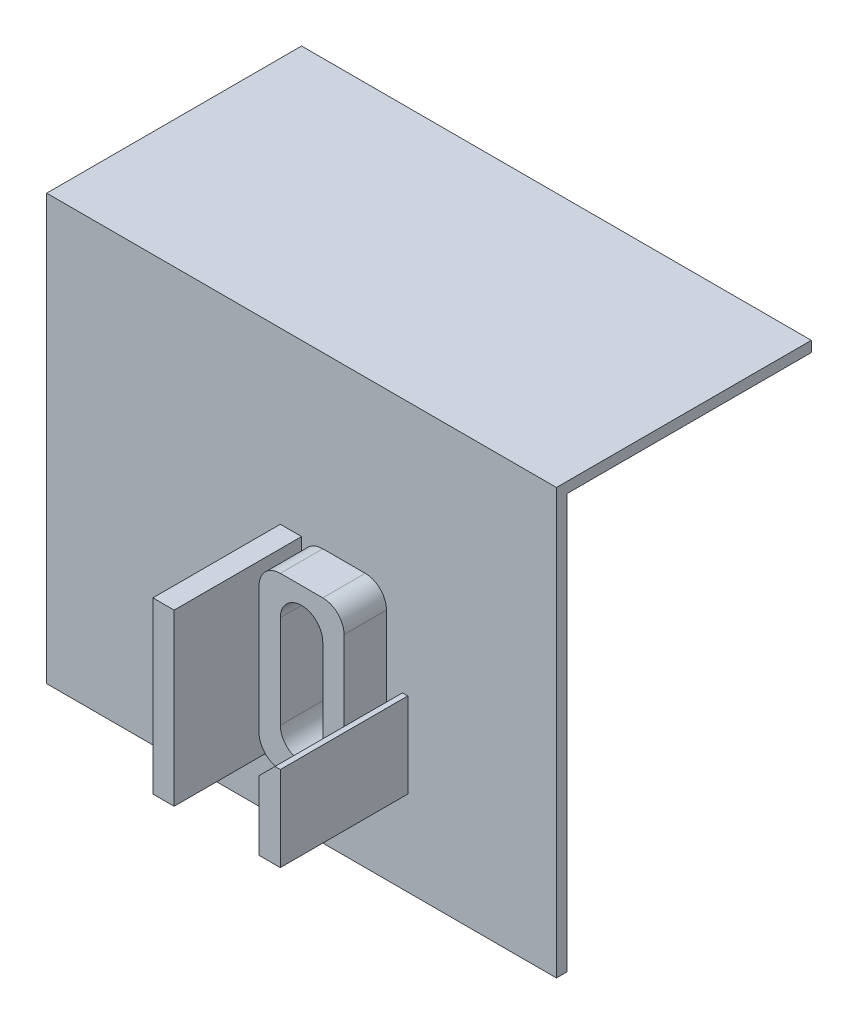
ISO-10303-21;
HEADER;
FILE_DESCRIPTION(('STEP AP214'),'2;1');
FILE_NAME('part.step','',(''),(''),'','','');
FILE_SCHEMA(('AUTOMOTIVE_DESIGN { 1 0 10303 214 1 1 1 1 }'));
ENDSEC;
DATA;
#1=APPLICATION_CONTEXT('core data for automotive mechanical design processes');
#2=APPLICATION_PROTOCOL_DEFINITION('international standard','automotive_design',2000,#1);
#3=PRODUCT_CONTEXT('',#1,'mechanical');
#4=PRODUCT('Part','Part','',(#3));
#5=PRODUCT_RELATED_PRODUCT_CATEGORY('part','',(#4));
#6=PRODUCT_DEFINITION_FORMATION('','',#4);
#7=PRODUCT_DEFINITION_CONTEXT('part definition',#1,'design');
#8=PRODUCT_DEFINITION('design','',#6,#7);
#9=PRODUCT_DEFINITION_SHAPE('','',#8);
#10=(LENGTH_UNIT() NAMED_UNIT(*) SI_UNIT(.MILLI.,.METRE.));
#11=(NAMED_UNIT(*) PLANE_ANGLE_UNIT() SI_UNIT($,.RADIAN.));
#12=(NAMED_UNIT(*) SI_UNIT($,.STERADIAN.) SOLID_ANGLE_UNIT());
#13=UNCERTAINTY_MEASURE_WITH_UNIT(LENGTH_MEASURE(1.E-05),#10,'distance_accuracy_value','');
#14=(GEOMETRIC_REPRESENTATION_CONTEXT(3) GLOBAL_UNCERTAINTY_ASSIGNED_CONTEXT((#13)) GLOBAL_UNIT_ASSIGNED_CONTEXT((#10,
#11,#12)) REPRESENTATION_CONTEXT('',''));
#15=CARTESIAN_POINT('',(0.,0.,0.));
#16=DIRECTION('',(0.,0.,1.));
#17=DIRECTION('',(1.,0.,0.));
#18=AXIS2_PLACEMENT_3D('',#15,#16,#17);
#19=CARTESIAN_POINT('',(76.2,0.,0.));
#20=DIRECTION('',(0.,0.,-1.));
#21=DIRECTION('',(-1.,0.,0.));
#22=AXIS2_PLACEMENT_3D('',#19,#20,#21);
#23=PLANE('',#22);
#24=DIRECTION('',(0.,-1.,0.));
#25=VECTOR('',#24,1.);
#26=CARTESIAN_POINT('',(0.,0.,0.));
#27=LINE('',#26,#25);
#28=CARTESIAN_POINT('',(0.,63.5,0.));
#29=VERTEX_POINT('',#28);
#30=CARTESIAN_POINT('',(0.,0.,0.));
#31=VERTEX_POINT('',#30);
#32=EDGE_CURVE('E422',#29,#31,#27,.T.);
#33=ORIENTED_EDGE('',*,*,#32,.T.);
#34=DIRECTION('',(-1.,0.,0.));
#35=VECTOR('',#34,1.);
#36=CARTESIAN_POINT('',(76.2,0.,0.));
#37=LINE('',#36,#35);
#38=CARTESIAN_POINT('',(76.2,0.,0.));
#39=VERTEX_POINT('',#38);
#40=EDGE_CURVE('E437',#39,#31,#37,.T.);
#41=ORIENTED_EDGE('',*,*,#40,.F.);
#42=DIRECTION('',(0.,-1.,0.));
#43=VECTOR('',#42,1.);
#44=CARTESIAN_POINT('',(76.2,0.,0.));
#45=LINE('',#44,#43);
#46=CARTESIAN_POINT('',(76.2,63.5,0.));
#47=VERTEX_POINT('',#46);
#48=EDGE_CURVE('E434',#47,#39,#45,.T.);
#49=ORIENTED_EDGE('',*,*,#48,.F.);
#50=DIRECTION('',(-1.,0.,0.));
#51=VECTOR('',#50,1.);
#52=CARTESIAN_POINT('',(76.2,63.5,0.));
#53=LINE('',#52,#51);
#54=EDGE_CURVE('E458',#47,#29,#53,.T.);
#55=ORIENTED_EDGE('',*,*,#54,.T.);
#56=EDGE_LOOP('',(#33,#41,#49,#55));
#57=FACE_BOUND('',#56,.T.);
#58=DIRECTION('',(0.,1.,0.));
#59=VECTOR('',#58,1.);
#60=CARTESIAN_POINT('',(38.1,12.7,0.));
#61=LINE('',#60,#59);
#62=CARTESIAN_POINT('',(38.1,12.7,0.));
#63=VERTEX_POINT('',#62);
#64=CARTESIAN_POINT('',(38.1,15.875,0.));
#65=VERTEX_POINT('',#64);
#66=EDGE_CURVE('E613',#63,#65,#61,.T.);
#67=ORIENTED_EDGE('',*,*,#66,.F.);
#68=DIRECTION('',(1.,0.,0.));
#69=VECTOR('',#68,1.);
#70=CARTESIAN_POINT('',(38.1,12.7,0.));
#71=LINE('',#70,#69);
#72=CARTESIAN_POINT('',(34.925,12.7,0.));
#73=VERTEX_POINT('',#72);
#74=EDGE_CURVE('E243',#73,#63,#71,.T.);
#75=ORIENTED_EDGE('',*,*,#74,.F.);
#76=DIRECTION('',(0.,-1.,0.));
#77=VECTOR('',#76,1.);
#78=CARTESIAN_POINT('',(34.925,12.7,0.));
#79=LINE('',#78,#77);
#80=CARTESIAN_POINT('',(34.925,38.1,0.));
#81=VERTEX_POINT('',#80);
#82=EDGE_CURVE('E620',#81,#73,#79,.T.);
#83=ORIENTED_EDGE('',*,*,#82,.F.);
#84=DIRECTION('',(-1.,0.,0.));
#85=VECTOR('',#84,1.);
#86=CARTESIAN_POINT('',(38.1,38.1,0.));
#87=LINE('',#86,#85);
#88=CARTESIAN_POINT('',(38.1,38.1,0.));
#89=VERTEX_POINT('',#88);
#90=EDGE_CURVE('E616',#89,#81,#87,.T.);
#91=ORIENTED_EDGE('',*,*,#90,.F.);
#92=CARTESIAN_POINT('',(38.1,34.925,0.));
#93=VERTEX_POINT('',#92);
#94=EDGE_CURVE('E247',#93,#89,#61,.T.);
#95=ORIENTED_EDGE('',*,*,#94,.F.);
#96=CARTESIAN_POINT('',(41.275,34.925,0.));
#97=DIRECTION('',(0.,0.,1.));
#98=DIRECTION('',(-1.,0.,0.));
#99=AXIS2_PLACEMENT_3D('',#96,#97,#98);
#100=CIRCLE('',#99,3.175);
#101=CARTESIAN_POINT('',(41.275,38.1,0.));
#102=VERTEX_POINT('',#101);
#103=EDGE_CURVE('E375',#102,#93,#100,.T.);
#104=ORIENTED_EDGE('',*,*,#103,.F.);
#105=DIRECTION('',(-1.,0.,0.));
#106=VECTOR('',#105,1.);
#107=CARTESIAN_POINT('',(41.275,38.1,0.));
#108=LINE('',#107,#106);
#109=CARTESIAN_POINT('',(47.625,38.1,0.));
#110=VERTEX_POINT('',#109);
#111=EDGE_CURVE('E371',#110,#102,#108,.T.);
#112=ORIENTED_EDGE('',*,*,#111,.F.);
#113=CARTESIAN_POINT('',(47.625,34.925,0.));
#114=DIRECTION('',(0.,0.,1.));
#115=DIRECTION('',(-1.,0.,0.));
#116=AXIS2_PLACEMENT_3D('',#113,#114,#115);
#117=CIRCLE('',#116,3.175);
#118=CARTESIAN_POINT('',(50.8,34.925,0.));
#119=VERTEX_POINT('',#118);
#120=EDGE_CURVE('E367',#119,#110,#117,.T.);
#121=ORIENTED_EDGE('',*,*,#120,.F.);
#122=DIRECTION('',(0.,1.,0.));
#123=VECTOR('',#122,1.);
#124=CARTESIAN_POINT('',(50.8,15.875,0.));
#125=LINE('',#124,#123);
#126=CARTESIAN_POINT('',(50.8,23.01875,0.));
#127=VERTEX_POINT('',#126);
#128=EDGE_CURVE('E364',#127,#119,#125,.T.);
#129=ORIENTED_EDGE('',*,*,#128,.F.);
#130=DIRECTION('',(-0.707106781186547,-0.707106781186548,0.));
#131=VECTOR('',#130,1.);
#132=CARTESIAN_POINT('',(50.8,23.01875,0.));
#133=LINE('',#132,#131);
#134=CARTESIAN_POINT('',(53.18125,25.4,0.));
#135=VERTEX_POINT('',#134);
#136=EDGE_CURVE('E55',#135,#127,#133,.T.);
#137=ORIENTED_EDGE('',*,*,#136,.F.);
#138=DIRECTION('',(-1.,0.,0.));
#139=VECTOR('',#138,1.);
#140=CARTESIAN_POINT('',(53.18125,25.4,0.));
#141=LINE('',#140,#139);
#142=CARTESIAN_POINT('',(53.975,25.4,0.));
#143=VERTEX_POINT('',#142);
#144=EDGE_CURVE('E59',#143,#135,#141,.T.);
#145=ORIENTED_EDGE('',*,*,#144,.F.);
#146=DIRECTION('',(0.,1.,0.));
#147=VECTOR('',#146,1.);
#148=CARTESIAN_POINT('',(53.975,25.4,0.));
#149=LINE('',#148,#147);
#150=CARTESIAN_POINT('',(53.975,12.7,0.));
#151=VERTEX_POINT('',#150);
#152=EDGE_CURVE('E254',#151,#143,#149,.T.);
#153=ORIENTED_EDGE('',*,*,#152,.F.);
#154=DIRECTION('',(1.,0.,0.));
#155=VECTOR('',#154,1.);
#156=CARTESIAN_POINT('',(53.975,12.7,0.));
#157=LINE('',#156,#155);
#158=CARTESIAN_POINT('',(50.8,12.7,0.));
#159=VERTEX_POINT('',#158);
#160=EDGE_CURVE('E249',#159,#151,#157,.T.);
#161=ORIENTED_EDGE('',*,*,#160,.F.);
#162=DIRECTION('',(0.,-1.,0.));
#163=VECTOR('',#162,1.);
#164=CARTESIAN_POINT('',(50.8,12.7,0.));
#165=LINE('',#164,#163);
#166=CARTESIAN_POINT('',(50.8,15.875,0.));
#167=VERTEX_POINT('',#166);
#168=EDGE_CURVE('E265',#167,#159,#165,.T.);
#169=ORIENTED_EDGE('',*,*,#168,.F.);
#170=CARTESIAN_POINT('',(47.625,15.875,0.));
#171=DIRECTION('',(0.,0.,1.));
#172=DIRECTION('',(1.,0.,0.));
#173=AXIS2_PLACEMENT_3D('',#170,#171,#172);
#174=CIRCLE('',#173,3.175);
#175=CARTESIAN_POINT('',(47.625,12.7,0.));
#176=VERTEX_POINT('',#175);
#177=EDGE_CURVE('E331',#176,#167,#174,.T.);
#178=ORIENTED_EDGE('',*,*,#177,.F.);
#179=DIRECTION('',(1.,0.,0.));
#180=VECTOR('',#179,1.);
#181=CARTESIAN_POINT('',(41.275,12.7,0.));
#182=LINE('',#181,#180);
#183=CARTESIAN_POINT('',(41.275,12.7,0.));
#184=VERTEX_POINT('',#183);
#185=EDGE_CURVE('E336',#184,#176,#182,.T.);
#186=ORIENTED_EDGE('',*,*,#185,.F.);
#187=CARTESIAN_POINT('',(41.275,15.875,0.));
#188=DIRECTION('',(0.,0.,1.));
#189=DIRECTION('',(-1.,0.,0.));
#190=AXIS2_PLACEMENT_3D('',#187,#188,#189);
#191=CIRCLE('',#190,3.175);
#192=EDGE_CURVE('E379',#65,#184,#191,.T.);
#193=ORIENTED_EDGE('',*,*,#192,.F.);
#194=EDGE_LOOP('',(#67,#75,#83,#91,#95,#104,#112,#121,#129,#137,#145,#153,#161,#169,#178,#186,#193));
#195=FACE_BOUND('',#194,.T.);
#196=ADVANCED_FACE('F39',(#57,#195),#23,.F.);
#197=CARTESIAN_POINT('',(50.8,15.875,6.35));
#198=DIRECTION('',(-1.,0.,0.));
#199=DIRECTION('',(0.,0.,1.));
#200=AXIS2_PLACEMENT_3D('',#197,#198,#199);
#201=PLANE('',#200);
#202=DIRECTION('',(0.,0.,1.));
#203=VECTOR('',#202,1.);
#204=CARTESIAN_POINT('',(50.8,23.01875,6.35));
#205=LINE('',#204,#203);
#206=CARTESIAN_POINT('',(50.8,23.01875,6.35));
#207=VERTEX_POINT('',#206);
#208=EDGE_CURVE('E11',#127,#207,#205,.T.);
#209=ORIENTED_EDGE('',*,*,#208,.F.);
#210=ORIENTED_EDGE('',*,*,#128,.T.);
#211=DIRECTION('',(0.,0.,-1.));
#212=VECTOR('',#211,1.);
#213=CARTESIAN_POINT('',(50.8,34.925,6.35));
#214=LINE('',#213,#212);
#215=CARTESIAN_POINT('',(50.8,34.925,6.35));
#216=VERTEX_POINT('',#215);
#217=EDGE_CURVE('E408',#216,#119,#214,.T.);
#218=ORIENTED_EDGE('',*,*,#217,.F.);
#219=DIRECTION('',(0.,1.,0.));
#220=VECTOR('',#219,1.);
#221=CARTESIAN_POINT('',(50.8,15.875,6.35));
#222=LINE('',#221,#220);
#223=EDGE_CURVE('E335',#207,#216,#222,.T.);
#224=ORIENTED_EDGE('',*,*,#223,.F.);
#225=EDGE_LOOP('',(#209,#210,#218,#224));
#226=FACE_BOUND('',#225,.T.);
#227=ADVANCED_FACE('F533',(#226),#201,.F.);
#228=CARTESIAN_POINT('',(76.2,0.,-1.5875));
#229=DIRECTION('',(0.,1.,0.));
#230=DIRECTION('',(0.,0.,1.));
#231=AXIS2_PLACEMENT_3D('',#228,#229,#230);
#232=PLANE('',#231);
#233=DIRECTION('',(0.,0.,-1.));
#234=VECTOR('',#233,1.);
#235=CARTESIAN_POINT('',(0.,0.,-1.5875));
#236=LINE('',#235,#234);
#237=CARTESIAN_POINT('',(0.,0.,-1.5875));
#238=VERTEX_POINT('',#237);
#239=EDGE_CURVE('E416',#31,#238,#236,.T.);
#240=ORIENTED_EDGE('',*,*,#239,.T.);
#241=DIRECTION('',(-1.,0.,0.));
#242=VECTOR('',#241,1.);
#243=CARTESIAN_POINT('',(76.2,0.,-1.5875));
#244=LINE('',#243,#242);
#245=CARTESIAN_POINT('',(76.2,0.,-1.5875));
#246=VERTEX_POINT('',#245);
#247=EDGE_CURVE('E474',#246,#238,#244,.T.);
#248=ORIENTED_EDGE('',*,*,#247,.F.);
#249=DIRECTION('',(0.,0.,-1.));
#250=VECTOR('',#249,1.);
#251=CARTESIAN_POINT('',(76.2,0.,-1.5875));
#252=LINE('',#251,#250);
#253=EDGE_CURVE('E417',#39,#246,#252,.T.);
#254=ORIENTED_EDGE('',*,*,#253,.F.);
#255=ORIENTED_EDGE('',*,*,#40,.T.);
#256=EDGE_LOOP('',(#240,#248,#254,#255));
#257=FACE_BOUND('',#256,.T.);
#258=ADVANCED_FACE('F41',(#257),#232,.F.);
#259=CARTESIAN_POINT('',(76.2,61.9125,-1.58749999999999));
#260=DIRECTION('',(0.,0.,1.));
#261=DIRECTION('',(0.,-1.,0.));
#262=AXIS2_PLACEMENT_3D('',#259,#260,#261);
#263=PLANE('',#262);
#264=DIRECTION('',(0.,-1.,0.));
#265=VECTOR('',#264,1.);
#266=CARTESIAN_POINT('',(41.275,61.9125,-1.58749999999999));
#267=LINE('',#266,#265);
#268=CARTESIAN_POINT('',(41.275,32.3582016438132,-1.5875));
#269=VERTEX_POINT('',#268);
#270=CARTESIAN_POINT('',(41.275,18.4417983561868,-1.5875));
#271=VERTEX_POINT('',#270);
#272=EDGE_CURVE('E486',#269,#271,#267,.T.);
#273=ORIENTED_EDGE('',*,*,#272,.T.);
#274=CARTESIAN_POINT('',(44.45,18.4417983561868,-1.5875));
#275=DIRECTION('',(0.,0.,1.));
#276=DIRECTION('',(0.,-1.,0.));
#277=AXIS2_PLACEMENT_3D('',#274,#275,#276);
#278=CIRCLE('',#277,3.17500000000001);
#279=CARTESIAN_POINT('',(47.625,18.4417983561868,-1.5875));
#280=VERTEX_POINT('',#279);
#281=EDGE_CURVE('E48',#271,#280,#278,.T.);
#282=ORIENTED_EDGE('',*,*,#281,.T.);
#283=DIRECTION('',(0.,1.,0.));
#284=VECTOR('',#283,1.);
#285=CARTESIAN_POINT('',(47.625,61.9125,-1.58749999999999));
#286=LINE('',#285,#284);
#287=CARTESIAN_POINT('',(47.625,32.3582016438132,-1.5875));
#288=VERTEX_POINT('',#287);
#289=EDGE_CURVE('E478',#280,#288,#286,.T.);
#290=ORIENTED_EDGE('',*,*,#289,.T.);
#291=CARTESIAN_POINT('',(44.45,32.3582016438132,-1.5875));
#292=DIRECTION('',(0.,0.,1.));
#293=DIRECTION('',(0.,-1.,0.));
#294=AXIS2_PLACEMENT_3D('',#291,#292,#293);
#295=CIRCLE('',#294,3.175);
#296=EDGE_CURVE('E482',#288,#269,#295,.T.);
#297=ORIENTED_EDGE('',*,*,#296,.T.);
#298=EDGE_LOOP('',(#273,#282,#290,#297));
#299=FACE_BOUND('',#298,.T.);
#300=DIRECTION('',(0.,1.,0.));
#301=VECTOR('',#300,1.);
#302=CARTESIAN_POINT('',(0.,61.9125,-1.58749999999999));
#303=LINE('',#302,#301);
#304=CARTESIAN_POINT('',(0.,61.9125,-1.58749999999999));
#305=VERTEX_POINT('',#304);
#306=EDGE_CURVE('E441',#238,#305,#303,.T.);
#307=ORIENTED_EDGE('',*,*,#306,.T.);
#308=DIRECTION('',(-1.,0.,0.));
#309=VECTOR('',#308,1.);
#310=CARTESIAN_POINT('',(76.2,61.9125,-1.58749999999999));
#311=LINE('',#310,#309);
#312=CARTESIAN_POINT('',(76.2,61.9125,-1.58749999999999));
#313=VERTEX_POINT('',#312);
#314=EDGE_CURVE('E470',#313,#305,#311,.T.);
#315=ORIENTED_EDGE('',*,*,#314,.F.);
#316=DIRECTION('',(0.,1.,0.));
#317=VECTOR('',#316,1.);
#318=CARTESIAN_POINT('',(76.2,61.9125,-1.58749999999999));
#319=LINE('',#318,#317);
#320=EDGE_CURVE('E421',#246,#313,#319,.T.);
#321=ORIENTED_EDGE('',*,*,#320,.F.);
#322=ORIENTED_EDGE('',*,*,#247,.T.);
#323=EDGE_LOOP('',(#307,#315,#321,#322));
#324=FACE_BOUND('',#323,.T.);
#325=ADVANCED_FACE('F493',(#299,#324),#263,.F.);
#326=CARTESIAN_POINT('',(76.2,61.9125,-38.1));
#327=DIRECTION('',(0.,1.,0.));
#328=DIRECTION('',(0.,0.,1.));
#329=AXIS2_PLACEMENT_3D('',#326,#327,#328);
#330=PLANE('',#329);
#331=DIRECTION('',(0.,0.,-1.));
#332=VECTOR('',#331,1.);
#333=CARTESIAN_POINT('',(0.,61.9125,-38.1));
#334=LINE('',#333,#332);
#335=CARTESIAN_POINT('',(0.,61.9125,-38.1));
#336=VERTEX_POINT('',#335);
#337=EDGE_CURVE('E444',#305,#336,#334,.T.);
#338=ORIENTED_EDGE('',*,*,#337,.T.);
#339=DIRECTION('',(-1.,0.,0.));
#340=VECTOR('',#339,1.);
#341=CARTESIAN_POINT('',(76.2,61.9125,-38.1));
#342=LINE('',#341,#340);
#343=CARTESIAN_POINT('',(76.2,61.9125,-38.1));
#344=VERTEX_POINT('',#343);
#345=EDGE_CURVE('E466',#344,#336,#342,.T.);
#346=ORIENTED_EDGE('',*,*,#345,.F.);
#347=DIRECTION('',(0.,0.,-1.));
#348=VECTOR('',#347,1.);
#349=CARTESIAN_POINT('',(76.2,61.9125,-38.1));
#350=LINE('',#349,#348);
#351=EDGE_CURVE('E425',#313,#344,#350,.T.);
#352=ORIENTED_EDGE('',*,*,#351,.F.);
#353=ORIENTED_EDGE('',*,*,#314,.T.);
#354=EDGE_LOOP('',(#338,#346,#352,#353));
#355=FACE_BOUND('',#354,.T.);
#356=ADVANCED_FACE('F550',(#355),#330,.F.);
#357=CARTESIAN_POINT('',(76.2,63.5,-38.1));
#358=DIRECTION('',(0.,0.,1.));
#359=DIRECTION('',(1.,0.,0.));
#360=AXIS2_PLACEMENT_3D('',#357,#358,#359);
#361=PLANE('',#360);
#362=DIRECTION('',(0.,1.,0.));
#363=VECTOR('',#362,1.);
#364=CARTESIAN_POINT('',(0.,63.5,-38.1));
#365=LINE('',#364,#363);
#366=CARTESIAN_POINT('',(0.,63.5,-38.1));
#367=VERTEX_POINT('',#366);
#368=EDGE_CURVE('E447',#336,#367,#365,.T.);
#369=ORIENTED_EDGE('',*,*,#368,.T.);
#370=DIRECTION('',(-1.,0.,0.));
#371=VECTOR('',#370,1.);
#372=CARTESIAN_POINT('',(76.2,63.5,-38.1));
#373=LINE('',#372,#371);
#374=CARTESIAN_POINT('',(76.2,63.5,-38.1));
#375=VERTEX_POINT('',#374);
#376=EDGE_CURVE('E462',#375,#367,#373,.T.);
#377=ORIENTED_EDGE('',*,*,#376,.F.);
#378=DIRECTION('',(0.,1.,0.));
#379=VECTOR('',#378,1.);
#380=CARTESIAN_POINT('',(76.2,63.5,-38.1));
#381=LINE('',#380,#379);
#382=EDGE_CURVE('E428',#344,#375,#381,.T.);
#383=ORIENTED_EDGE('',*,*,#382,.F.);
#384=ORIENTED_EDGE('',*,*,#345,.T.);
#385=EDGE_LOOP('',(#369,#377,#383,#384));
#386=FACE_BOUND('',#385,.T.);
#387=ADVANCED_FACE('F546',(#386),#361,.F.);
#388=CARTESIAN_POINT('',(76.2,63.5,0.));
#389=DIRECTION('',(0.,-1.,0.));
#390=DIRECTION('',(0.,0.,-1.));
#391=AXIS2_PLACEMENT_3D('',#388,#389,#390);
#392=PLANE('',#391);
#393=DIRECTION('',(0.,0.,1.));
#394=VECTOR('',#393,1.);
#395=CARTESIAN_POINT('',(0.,63.5,0.));
#396=LINE('',#395,#394);
#397=EDGE_CURVE('E450',#367,#29,#396,.T.);
#398=ORIENTED_EDGE('',*,*,#397,.T.);
#399=ORIENTED_EDGE('',*,*,#54,.F.);
#400=DIRECTION('',(0.,0.,1.));
#401=VECTOR('',#400,1.);
#402=CARTESIAN_POINT('',(76.2,63.5,0.));
#403=LINE('',#402,#401);
#404=EDGE_CURVE('E431',#375,#47,#403,.T.);
#405=ORIENTED_EDGE('',*,*,#404,.F.);
#406=ORIENTED_EDGE('',*,*,#376,.T.);
#407=EDGE_LOOP('',(#398,#399,#405,#406));
#408=FACE_BOUND('',#407,.T.);
#409=ADVANCED_FACE('F543',(#408),#392,.F.);
#410=CARTESIAN_POINT('',(76.2,0.,0.));
#411=DIRECTION('',(-1.,0.,0.));
#412=DIRECTION('',(0.,0.,1.));
#413=AXIS2_PLACEMENT_3D('',#410,#411,#412);
#414=PLANE('',#413);
#415=ORIENTED_EDGE('',*,*,#253,.T.);
#416=ORIENTED_EDGE('',*,*,#320,.T.);
#417=ORIENTED_EDGE('',*,*,#351,.T.);
#418=ORIENTED_EDGE('',*,*,#382,.T.);
#419=ORIENTED_EDGE('',*,*,#404,.T.);
#420=ORIENTED_EDGE('',*,*,#48,.T.);
#421=EDGE_LOOP('',(#415,#416,#417,#418,#419,#420));
#422=FACE_BOUND('',#421,.T.);
#423=ADVANCED_FACE('F527',(#422),#414,.F.);
#424=CARTESIAN_POINT('',(0.,0.,0.));
#425=DIRECTION('',(-1.,0.,0.));
#426=DIRECTION('',(0.,0.,1.));
#427=AXIS2_PLACEMENT_3D('',#424,#425,#426);
#428=PLANE('',#427);
#429=ORIENTED_EDGE('',*,*,#239,.F.);
#430=ORIENTED_EDGE('',*,*,#32,.F.);
#431=ORIENTED_EDGE('',*,*,#397,.F.);
#432=ORIENTED_EDGE('',*,*,#368,.F.);
#433=ORIENTED_EDGE('',*,*,#337,.F.);
#434=ORIENTED_EDGE('',*,*,#306,.F.);
#435=EDGE_LOOP('',(#429,#430,#431,#432,#433,#434));
#436=FACE_BOUND('',#435,.T.);
#437=ADVANCED_FACE('F517',(#436),#428,.T.);
#438=CARTESIAN_POINT('',(47.625,15.875,6.35));
#439=DIRECTION('',(0.,0.,1.));
#440=DIRECTION('',(1.,0.,0.));
#441=AXIS2_PLACEMENT_3D('',#438,#439,#440);
#442=PLANE('',#441);
#443=CARTESIAN_POINT('',(47.625,15.875,6.35));
#444=DIRECTION('',(0.,0.,1.));
#445=DIRECTION('',(1.,0.,0.));
#446=AXIS2_PLACEMENT_3D('',#443,#444,#445);
#447=CIRCLE('',#446,3.175);
#448=CARTESIAN_POINT('',(47.625,12.7,6.35));
#449=VERTEX_POINT('',#448);
#450=CARTESIAN_POINT('',(50.8,15.875,6.35));
#451=VERTEX_POINT('',#450);
#452=EDGE_CURVE('E332',#449,#451,#447,.T.);
#453=ORIENTED_EDGE('',*,*,#452,.T.);
#454=EDGE_CURVE('E337',#451,#207,#222,.T.);
#455=ORIENTED_EDGE('',*,*,#454,.T.);
#456=ORIENTED_EDGE('',*,*,#223,.T.);
#457=CARTESIAN_POINT('',(47.625,34.925,6.35));
#458=DIRECTION('',(0.,0.,1.));
#459=DIRECTION('',(-1.,0.,0.));
#460=AXIS2_PLACEMENT_3D('',#457,#458,#459);
#461=CIRCLE('',#460,3.175);
#462=CARTESIAN_POINT('',(47.625,38.1,6.35));
#463=VERTEX_POINT('',#462);
#464=EDGE_CURVE('E340',#216,#463,#461,.T.);
#465=ORIENTED_EDGE('',*,*,#464,.T.);
#466=DIRECTION('',(-1.,0.,0.));
#467=VECTOR('',#466,1.);
#468=CARTESIAN_POINT('',(41.275,38.1,6.35));
#469=LINE('',#468,#467);
#470=CARTESIAN_POINT('',(41.275,38.1,6.35));
#471=VERTEX_POINT('',#470);
#472=EDGE_CURVE('E343',#463,#471,#469,.T.);
#473=ORIENTED_EDGE('',*,*,#472,.T.);
#474=CARTESIAN_POINT('',(41.275,34.925,6.35));
#475=DIRECTION('',(0.,0.,1.));
#476=DIRECTION('',(-1.,0.,0.));
#477=AXIS2_PLACEMENT_3D('',#474,#475,#476);
#478=CIRCLE('',#477,3.175);
#479=CARTESIAN_POINT('',(38.1,34.925,6.35));
#480=VERTEX_POINT('',#479);
#481=EDGE_CURVE('E346',#471,#480,#478,.T.);
#482=ORIENTED_EDGE('',*,*,#481,.T.);
#483=DIRECTION('',(0.,-1.,0.));
#484=VECTOR('',#483,1.);
#485=CARTESIAN_POINT('',(38.1,15.875,6.35));
#486=LINE('',#485,#484);
#487=CARTESIAN_POINT('',(38.1,15.875,6.35));
#488=VERTEX_POINT('',#487);
#489=EDGE_CURVE('E350',#480,#488,#486,.T.);
#490=ORIENTED_EDGE('',*,*,#489,.T.);
#491=CARTESIAN_POINT('',(41.275,15.875,6.35));
#492=DIRECTION('',(0.,0.,1.));
#493=DIRECTION('',(-1.,0.,0.));
#494=AXIS2_PLACEMENT_3D('',#491,#492,#493);
#495=CIRCLE('',#494,3.175);
#496=CARTESIAN_POINT('',(41.275,12.7,6.35));
#497=VERTEX_POINT('',#496);
#498=EDGE_CURVE('E354',#488,#497,#495,.T.);
#499=ORIENTED_EDGE('',*,*,#498,.T.);
#500=DIRECTION('',(1.,0.,0.));
#501=VECTOR('',#500,1.);
#502=CARTESIAN_POINT('',(41.275,12.7,6.35));
#503=LINE('',#502,#501);
#504=EDGE_CURVE('E357',#497,#449,#503,.T.);
#505=ORIENTED_EDGE('',*,*,#504,.T.);
#506=EDGE_LOOP('',(#453,#455,#456,#465,#473,#482,#490,#499,#505));
#507=FACE_BOUND('',#506,.T.);
#508=DIRECTION('',(0.,-1.,0.));
#509=VECTOR('',#508,1.);
#510=CARTESIAN_POINT('',(41.275,32.3582016438132,6.35));
#511=LINE('',#510,#509);
#512=CARTESIAN_POINT('',(41.275,32.3582016438132,6.35));
#513=VERTEX_POINT('',#512);
#514=CARTESIAN_POINT('',(41.275,18.4417983561868,6.35));
#515=VERTEX_POINT('',#514);
#516=EDGE_CURVE('E309',#513,#515,#511,.T.);
#517=ORIENTED_EDGE('',*,*,#516,.F.);
#518=CARTESIAN_POINT('',(44.45,32.3582016438132,6.35));
#519=DIRECTION('',(0.,0.,1.));
#520=DIRECTION('',(-1.,0.,0.));
#521=AXIS2_PLACEMENT_3D('',#518,#519,#520);
#522=CIRCLE('',#521,3.175);
#523=CARTESIAN_POINT('',(47.625,32.3582016438132,6.35));
#524=VERTEX_POINT('',#523);
#525=EDGE_CURVE('E306',#524,#513,#522,.T.);
#526=ORIENTED_EDGE('',*,*,#525,.F.);
#527=DIRECTION('',(0.,1.,0.));
#528=VECTOR('',#527,1.);
#529=CARTESIAN_POINT('',(47.625,18.4417983561868,6.35));
#530=LINE('',#529,#528);
#531=CARTESIAN_POINT('',(47.625,18.4417983561868,6.35));
#532=VERTEX_POINT('',#531);
#533=EDGE_CURVE('E316',#532,#524,#530,.T.);
#534=ORIENTED_EDGE('',*,*,#533,.F.);
#535=CARTESIAN_POINT('',(44.45,18.4417983561868,6.35));
#536=DIRECTION('',(0.,0.,1.));
#537=DIRECTION('',(-1.,0.,0.));
#538=AXIS2_PLACEMENT_3D('',#535,#536,#537);
#539=CIRCLE('',#538,3.175);
#540=EDGE_CURVE('E312',#515,#532,#539,.T.);
#541=ORIENTED_EDGE('',*,*,#540,.F.);
#542=EDGE_LOOP('',(#517,#526,#534,#541));
#543=FACE_BOUND('',#542,.T.);
#544=ADVANCED_FACE('F514',(#507,#543),#442,.T.);
#545=CARTESIAN_POINT('',(47.625,15.875,6.35));
#546=DIRECTION('',(0.,0.,-1.));
#547=DIRECTION('',(-1.,0.,0.));
#548=AXIS2_PLACEMENT_3D('',#545,#546,#547);
#549=CYLINDRICAL_SURFACE('',#548,3.175);
#550=ORIENTED_EDGE('',*,*,#177,.T.);
#551=DIRECTION('',(0.,0.,-1.));
#552=VECTOR('',#551,1.);
#553=CARTESIAN_POINT('',(50.8,15.875,6.35));
#554=LINE('',#553,#552);
#555=EDGE_CURVE('E412',#451,#167,#554,.T.);
#556=ORIENTED_EDGE('',*,*,#555,.F.);
#557=ORIENTED_EDGE('',*,*,#452,.F.);
#558=DIRECTION('',(0.,0.,-1.));
#559=VECTOR('',#558,1.);
#560=CARTESIAN_POINT('',(47.625,12.7,6.35));
#561=LINE('',#560,#559);
#562=EDGE_CURVE('E360',#449,#176,#561,.T.);
#563=ORIENTED_EDGE('',*,*,#562,.T.);
#564=EDGE_LOOP('',(#550,#556,#557,#563));
#565=FACE_BOUND('',#564,.T.);
#566=ADVANCED_FACE('F516',(#565),#549,.T.);
#567=CARTESIAN_POINT('',(47.625,34.925,6.35));
#568=DIRECTION('',(0.,0.,-1.));
#569=DIRECTION('',(-1.,0.,0.));
#570=AXIS2_PLACEMENT_3D('',#567,#568,#569);
#571=CYLINDRICAL_SURFACE('',#570,3.175);
#572=ORIENTED_EDGE('',*,*,#120,.T.);
#573=DIRECTION('',(0.,0.,-1.));
#574=VECTOR('',#573,1.);
#575=CARTESIAN_POINT('',(47.625,38.1,6.35));
#576=LINE('',#575,#574);
#577=EDGE_CURVE('E404',#463,#110,#576,.T.);
#578=ORIENTED_EDGE('',*,*,#577,.F.);
#579=ORIENTED_EDGE('',*,*,#464,.F.);
#580=ORIENTED_EDGE('',*,*,#217,.T.);
#581=EDGE_LOOP('',(#572,#578,#579,#580));
#582=FACE_BOUND('',#581,.T.);
#583=ADVANCED_FACE('F524',(#582),#571,.T.);
#584=CARTESIAN_POINT('',(41.275,38.1,6.35));
#585=DIRECTION('',(0.,-1.,0.));
#586=DIRECTION('',(0.,0.,-1.));
#587=AXIS2_PLACEMENT_3D('',#584,#585,#586);
#588=PLANE('',#587);
#589=ORIENTED_EDGE('',*,*,#111,.T.);
#590=DIRECTION('',(0.,0.,-1.));
#591=VECTOR('',#590,1.);
#592=CARTESIAN_POINT('',(41.275,38.1,6.35));
#593=LINE('',#592,#591);
#594=EDGE_CURVE('E400',#471,#102,#593,.T.);
#595=ORIENTED_EDGE('',*,*,#594,.F.);
#596=ORIENTED_EDGE('',*,*,#472,.F.);
#597=ORIENTED_EDGE('',*,*,#577,.T.);
#598=EDGE_LOOP('',(#589,#595,#596,#597));
#599=FACE_BOUND('',#598,.T.);
#600=ADVANCED_FACE('F584',(#599),#588,.F.);
#601=CARTESIAN_POINT('',(41.275,34.925,6.35));
#602=DIRECTION('',(0.,0.,-1.));
#603=DIRECTION('',(-1.,0.,0.));
#604=AXIS2_PLACEMENT_3D('',#601,#602,#603);
#605=CYLINDRICAL_SURFACE('',#604,3.175);
#606=ORIENTED_EDGE('',*,*,#103,.T.);
#607=DIRECTION('',(0.,0.,-1.));
#608=VECTOR('',#607,1.);
#609=CARTESIAN_POINT('',(38.1,34.925,6.35));
#610=LINE('',#609,#608);
#611=EDGE_CURVE('E397',#480,#93,#610,.T.);
#612=ORIENTED_EDGE('',*,*,#611,.F.);
#613=ORIENTED_EDGE('',*,*,#481,.F.);
#614=ORIENTED_EDGE('',*,*,#594,.T.);
#615=EDGE_LOOP('',(#606,#612,#613,#614));
#616=FACE_BOUND('',#615,.T.);
#617=ADVANCED_FACE('F588',(#616),#605,.T.);
#618=CARTESIAN_POINT('',(41.275,15.875,6.35));
#619=DIRECTION('',(0.,0.,-1.));
#620=DIRECTION('',(-1.,0.,0.));
#621=AXIS2_PLACEMENT_3D('',#618,#619,#620);
#622=CYLINDRICAL_SURFACE('',#621,3.175);
#623=ORIENTED_EDGE('',*,*,#192,.T.);
#624=DIRECTION('',(0.,0.,-1.));
#625=VECTOR('',#624,1.);
#626=CARTESIAN_POINT('',(41.275,12.7,6.35));
#627=LINE('',#626,#625);
#628=EDGE_CURVE('E389',#497,#184,#627,.T.);
#629=ORIENTED_EDGE('',*,*,#628,.F.);
#630=ORIENTED_EDGE('',*,*,#498,.F.);
#631=DIRECTION('',(0.,0.,-1.));
#632=VECTOR('',#631,1.);
#633=CARTESIAN_POINT('',(38.1,15.875,6.35));
#634=LINE('',#633,#632);
#635=EDGE_CURVE('E393',#488,#65,#634,.T.);
#636=ORIENTED_EDGE('',*,*,#635,.T.);
#637=EDGE_LOOP('',(#623,#629,#630,#636));
#638=FACE_BOUND('',#637,.T.);
#639=ADVANCED_FACE('F592',(#638),#622,.T.);
#640=CARTESIAN_POINT('',(41.275,12.7,6.35));
#641=DIRECTION('',(0.,1.,0.));
#642=DIRECTION('',(0.,0.,1.));
#643=AXIS2_PLACEMENT_3D('',#640,#641,#642);
#644=PLANE('',#643);
#645=ORIENTED_EDGE('',*,*,#185,.T.);
#646=ORIENTED_EDGE('',*,*,#562,.F.);
#647=ORIENTED_EDGE('',*,*,#504,.F.);
#648=ORIENTED_EDGE('',*,*,#628,.T.);
#649=EDGE_LOOP('',(#645,#646,#647,#648));
#650=FACE_BOUND('',#649,.T.);
#651=ADVANCED_FACE('F595',(#650),#644,.F.);
#652=CARTESIAN_POINT('',(44.45,32.3582016438132,6.35));
#653=DIRECTION('',(0.,0.,-1.));
#654=DIRECTION('',(-1.,0.,0.));
#655=AXIS2_PLACEMENT_3D('',#652,#653,#654);
#656=CYLINDRICAL_SURFACE('',#655,3.175);
#657=DIRECTION('',(0.,0.,-1.));
#658=VECTOR('',#657,1.);
#659=CARTESIAN_POINT('',(41.275,32.3582016438132,6.35));
#660=LINE('',#659,#658);
#661=EDGE_CURVE('E328',#513,#269,#660,.T.);
#662=ORIENTED_EDGE('',*,*,#661,.T.);
#663=ORIENTED_EDGE('',*,*,#296,.F.);
#664=DIRECTION('',(0.,0.,-1.));
#665=VECTOR('',#664,1.);
#666=CARTESIAN_POINT('',(47.625,32.3582016438132,6.35));
#667=LINE('',#666,#665);
#668=EDGE_CURVE('E319',#524,#288,#667,.T.);
#669=ORIENTED_EDGE('',*,*,#668,.F.);
#670=ORIENTED_EDGE('',*,*,#525,.T.);
#671=EDGE_LOOP('',(#662,#663,#669,#670));
#672=FACE_BOUND('',#671,.T.);
#673=ADVANCED_FACE('F508',(#672),#656,.F.);
#674=CARTESIAN_POINT('',(41.275,32.3582016438132,6.35));
#675=DIRECTION('',(1.,0.,0.));
#676=DIRECTION('',(0.,0.,-1.));
#677=AXIS2_PLACEMENT_3D('',#674,#675,#676);
#678=PLANE('',#677);
#679=DIRECTION('',(0.,0.,-1.));
#680=VECTOR('',#679,1.);
#681=CARTESIAN_POINT('',(41.275,18.4417983561868,6.35));
#682=LINE('',#681,#680);
#683=EDGE_CURVE('E325',#515,#271,#682,.T.);
#684=ORIENTED_EDGE('',*,*,#683,.T.);
#685=ORIENTED_EDGE('',*,*,#272,.F.);
#686=ORIENTED_EDGE('',*,*,#661,.F.);
#687=ORIENTED_EDGE('',*,*,#516,.T.);
#688=EDGE_LOOP('',(#684,#685,#686,#687));
#689=FACE_BOUND('',#688,.T.);
#690=ADVANCED_FACE('F512',(#689),#678,.T.);
#691=CARTESIAN_POINT('',(44.45,18.4417983561868,6.35));
#692=DIRECTION('',(0.,0.,-1.));
#693=DIRECTION('',(-1.,0.,0.));
#694=AXIS2_PLACEMENT_3D('',#691,#692,#693);
#695=CYLINDRICAL_SURFACE('',#694,3.175);
#696=DIRECTION('',(0.,0.,-1.));
#697=VECTOR('',#696,1.);
#698=CARTESIAN_POINT('',(47.625,18.4417983561868,6.35));
#699=LINE('',#698,#697);
#700=EDGE_CURVE('E322',#532,#280,#699,.T.);
#701=ORIENTED_EDGE('',*,*,#700,.T.);
#702=ORIENTED_EDGE('',*,*,#281,.F.);
#703=ORIENTED_EDGE('',*,*,#683,.F.);
#704=ORIENTED_EDGE('',*,*,#540,.T.);
#705=EDGE_LOOP('',(#701,#702,#703,#704));
#706=FACE_BOUND('',#705,.T.);
#707=ADVANCED_FACE('F499',(#706),#695,.F.);
#708=CARTESIAN_POINT('',(47.625,18.4417983561868,6.35));
#709=DIRECTION('',(-1.,0.,0.));
#710=DIRECTION('',(0.,0.,1.));
#711=AXIS2_PLACEMENT_3D('',#708,#709,#710);
#712=PLANE('',#711);
#713=ORIENTED_EDGE('',*,*,#668,.T.);
#714=ORIENTED_EDGE('',*,*,#289,.F.);
#715=ORIENTED_EDGE('',*,*,#700,.F.);
#716=ORIENTED_EDGE('',*,*,#533,.T.);
#717=EDGE_LOOP('',(#713,#714,#715,#716));
#718=FACE_BOUND('',#717,.T.);
#719=ADVANCED_FACE('F503',(#718),#712,.T.);
#720=CARTESIAN_POINT('',(53.975,12.7,19.05));
#721=DIRECTION('',(0.,1.,0.));
#722=DIRECTION('',(0.,0.,1.));
#723=AXIS2_PLACEMENT_3D('',#720,#721,#722);
#724=PLANE('',#723);
#725=ORIENTED_EDGE('',*,*,#160,.T.);
#726=DIRECTION('',(0.,0.,-1.));
#727=VECTOR('',#726,1.);
#728=CARTESIAN_POINT('',(53.975,12.7,19.05));
#729=LINE('',#728,#727);
#730=CARTESIAN_POINT('',(53.975,12.7,19.05));
#731=VERTEX_POINT('',#730);
#732=EDGE_CURVE('E302',#731,#151,#729,.T.);
#733=ORIENTED_EDGE('',*,*,#732,.F.);
#734=DIRECTION('',(1.,0.,0.));
#735=VECTOR('',#734,1.);
#736=CARTESIAN_POINT('',(53.975,12.7,19.05));
#737=LINE('',#736,#735);
#738=CARTESIAN_POINT('',(50.8,12.7,19.05));
#739=VERTEX_POINT('',#738);
#740=EDGE_CURVE('E260',#739,#731,#737,.T.);
#741=ORIENTED_EDGE('',*,*,#740,.F.);
#742=DIRECTION('',(0.,0.,-1.));
#743=VECTOR('',#742,1.);
#744=CARTESIAN_POINT('',(50.8,12.7,19.05));
#745=LINE('',#744,#743);
#746=EDGE_CURVE('E276',#739,#159,#745,.T.);
#747=ORIENTED_EDGE('',*,*,#746,.T.);
#748=EDGE_LOOP('',(#725,#733,#741,#747));
#749=FACE_BOUND('',#748,.T.);
#750=ADVANCED_FACE('F664',(#749),#724,.F.);
#751=CARTESIAN_POINT('',(53.975,25.4,19.05));
#752=DIRECTION('',(-1.,0.,0.));
#753=DIRECTION('',(0.,0.,1.));
#754=AXIS2_PLACEMENT_3D('',#751,#752,#753);
#755=PLANE('',#754);
#756=ORIENTED_EDGE('',*,*,#152,.T.);
#757=DIRECTION('',(0.,0.,-1.));
#758=VECTOR('',#757,1.);
#759=CARTESIAN_POINT('',(53.975,25.4,19.05));
#760=LINE('',#759,#758);
#761=CARTESIAN_POINT('',(53.975,25.4,19.05));
#762=VERTEX_POINT('',#761);
#763=EDGE_CURVE('E298',#762,#143,#760,.T.);
#764=ORIENTED_EDGE('',*,*,#763,.F.);
#765=DIRECTION('',(0.,1.,0.));
#766=VECTOR('',#765,1.);
#767=CARTESIAN_POINT('',(53.975,25.4,19.05));
#768=LINE('',#767,#766);
#769=EDGE_CURVE('E264',#731,#762,#768,.T.);
#770=ORIENTED_EDGE('',*,*,#769,.F.);
#771=ORIENTED_EDGE('',*,*,#732,.T.);
#772=EDGE_LOOP('',(#756,#764,#770,#771));
#773=FACE_BOUND('',#772,.T.);
#774=ADVANCED_FACE('F656',(#773),#755,.F.);
#775=CARTESIAN_POINT('',(53.18125,25.4,19.05));
#776=DIRECTION('',(0.,-1.,0.));
#777=DIRECTION('',(1.,0.,0.));
#778=AXIS2_PLACEMENT_3D('',#775,#776,#777);
#779=PLANE('',#778);
#780=ORIENTED_EDGE('',*,*,#144,.T.);
#781=DIRECTION('',(0.,0.,-1.));
#782=VECTOR('',#781,1.);
#783=CARTESIAN_POINT('',(53.18125,25.4,19.05));
#784=LINE('',#783,#782);
#785=CARTESIAN_POINT('',(53.18125,25.4,19.05));
#786=VERTEX_POINT('',#785);
#787=EDGE_CURVE('E294',#786,#135,#784,.T.);
#788=ORIENTED_EDGE('',*,*,#787,.F.);
#789=DIRECTION('',(-1.,0.,0.));
#790=VECTOR('',#789,1.);
#791=CARTESIAN_POINT('',(53.18125,25.4,19.05));
#792=LINE('',#791,#790);
#793=EDGE_CURVE('E268',#762,#786,#792,.T.);
#794=ORIENTED_EDGE('',*,*,#793,.F.);
#795=ORIENTED_EDGE('',*,*,#763,.T.);
#796=EDGE_LOOP('',(#780,#788,#794,#795));
#797=FACE_BOUND('',#796,.T.);
#798=ADVANCED_FACE('F653',(#797),#779,.F.);
#799=CARTESIAN_POINT('',(50.8,23.01875,19.05));
#800=DIRECTION('',(0.707106781186548,-0.707106781186547,0.));
#801=DIRECTION('',(0.707106781186547,0.707106781186548,0.));
#802=AXIS2_PLACEMENT_3D('',#799,#800,#801);
#803=PLANE('',#802);
#804=ORIENTED_EDGE('',*,*,#136,.T.);
#805=ORIENTED_EDGE('',*,*,#208,.T.);
#806=DIRECTION('',(0.,0.,-1.));
#807=VECTOR('',#806,1.);
#808=CARTESIAN_POINT('',(50.8,23.01875,19.05));
#809=LINE('',#808,#807);
#810=CARTESIAN_POINT('',(50.8,23.01875,19.05));
#811=VERTEX_POINT('',#810);
#812=EDGE_CURVE('E290',#811,#207,#809,.T.);
#813=ORIENTED_EDGE('',*,*,#812,.F.);
#814=DIRECTION('',(-0.707106781186547,-0.707106781186548,0.));
#815=VECTOR('',#814,1.);
#816=CARTESIAN_POINT('',(50.8,23.01875,19.05));
#817=LINE('',#816,#815);
#818=EDGE_CURVE('E271',#786,#811,#817,.T.);
#819=ORIENTED_EDGE('',*,*,#818,.F.);
#820=ORIENTED_EDGE('',*,*,#787,.T.);
#821=EDGE_LOOP('',(#804,#805,#813,#819,#820));
#822=FACE_BOUND('',#821,.T.);
#823=ADVANCED_FACE('F647',(#822),#803,.F.);
#824=CARTESIAN_POINT('',(50.8,12.7,19.05));
#825=DIRECTION('',(1.,0.,0.));
#826=DIRECTION('',(0.,0.,-1.));
#827=AXIS2_PLACEMENT_3D('',#824,#825,#826);
#828=PLANE('',#827);
#829=ORIENTED_EDGE('',*,*,#454,.F.);
#830=ORIENTED_EDGE('',*,*,#555,.T.);
#831=ORIENTED_EDGE('',*,*,#168,.T.);
#832=ORIENTED_EDGE('',*,*,#746,.F.);
#833=DIRECTION('',(0.,-1.,0.));
#834=VECTOR('',#833,1.);
#835=CARTESIAN_POINT('',(50.8,12.7,19.05));
#836=LINE('',#835,#834);
#837=EDGE_CURVE('E274',#811,#739,#836,.T.);
#838=ORIENTED_EDGE('',*,*,#837,.F.);
#839=ORIENTED_EDGE('',*,*,#812,.T.);
#840=EDGE_LOOP('',(#829,#830,#831,#832,#838,#839));
#841=FACE_BOUND('',#840,.T.);
#842=ADVANCED_FACE('F661',(#841),#828,.F.);
#843=CARTESIAN_POINT('',(0.,0.,19.05));
#844=DIRECTION('',(0.,0.,-1.));
#845=DIRECTION('',(-1.,0.,0.));
#846=AXIS2_PLACEMENT_3D('',#843,#844,#845);
#847=PLANE('',#846);
#848=ORIENTED_EDGE('',*,*,#740,.T.);
#849=ORIENTED_EDGE('',*,*,#769,.T.);
#850=ORIENTED_EDGE('',*,*,#793,.T.);
#851=ORIENTED_EDGE('',*,*,#818,.T.);
#852=ORIENTED_EDGE('',*,*,#837,.T.);
#853=EDGE_LOOP('',(#848,#849,#850,#851,#852));
#854=FACE_BOUND('',#853,.T.);
#855=ADVANCED_FACE('F666',(#854),#847,.F.);
#856=CARTESIAN_POINT('',(38.1,12.7,19.05));
#857=DIRECTION('',(-1.,0.,0.));
#858=DIRECTION('',(0.,0.,1.));
#859=AXIS2_PLACEMENT_3D('',#856,#857,#858);
#860=PLANE('',#859);
#861=ORIENTED_EDGE('',*,*,#489,.F.);
#862=ORIENTED_EDGE('',*,*,#611,.T.);
#863=ORIENTED_EDGE('',*,*,#94,.T.);
#864=DIRECTION('',(0.,0.,-1.));
#865=VECTOR('',#864,1.);
#866=CARTESIAN_POINT('',(38.1,38.1,19.05));
#867=LINE('',#866,#865);
#868=CARTESIAN_POINT('',(38.1,38.1,19.05));
#869=VERTEX_POINT('',#868);
#870=EDGE_CURVE('E225',#869,#89,#867,.T.);
#871=ORIENTED_EDGE('',*,*,#870,.F.);
#872=DIRECTION('',(0.,1.,0.));
#873=VECTOR('',#872,1.);
#874=CARTESIAN_POINT('',(38.1,12.7,19.05));
#875=LINE('',#874,#873);
#876=CARTESIAN_POINT('',(38.1,12.7,19.05));
#877=VERTEX_POINT('',#876);
#878=EDGE_CURVE('E233',#877,#869,#875,.T.);
#879=ORIENTED_EDGE('',*,*,#878,.F.);
#880=DIRECTION('',(0.,0.,-1.));
#881=VECTOR('',#880,1.);
#882=CARTESIAN_POINT('',(38.1,12.7,19.05));
#883=LINE('',#882,#881);
#884=EDGE_CURVE('E629',#877,#63,#883,.T.);
#885=ORIENTED_EDGE('',*,*,#884,.T.);
#886=ORIENTED_EDGE('',*,*,#66,.T.);
#887=ORIENTED_EDGE('',*,*,#635,.F.);
#888=EDGE_LOOP('',(#861,#862,#863,#871,#879,#885,#886,#887));
#889=FACE_BOUND('',#888,.T.);
#890=ADVANCED_FACE('F245',(#889),#860,.F.);
#891=CARTESIAN_POINT('',(38.1,38.1,19.05));
#892=DIRECTION('',(0.,-1.,0.));
#893=DIRECTION('',(0.,0.,-1.));
#894=AXIS2_PLACEMENT_3D('',#891,#892,#893);
#895=PLANE('',#894);
#896=ORIENTED_EDGE('',*,*,#90,.T.);
#897=DIRECTION('',(0.,0.,-1.));
#898=VECTOR('',#897,1.);
#899=CARTESIAN_POINT('',(34.925,38.1,19.05));
#900=LINE('',#899,#898);
#901=CARTESIAN_POINT('',(34.925,38.1,19.05));
#902=VERTEX_POINT('',#901);
#903=EDGE_CURVE('E228',#902,#81,#900,.T.);
#904=ORIENTED_EDGE('',*,*,#903,.F.);
#905=DIRECTION('',(-1.,0.,0.));
#906=VECTOR('',#905,1.);
#907=CARTESIAN_POINT('',(38.1,38.1,19.05));
#908=LINE('',#907,#906);
#909=EDGE_CURVE('E221',#869,#902,#908,.T.);
#910=ORIENTED_EDGE('',*,*,#909,.F.);
#911=ORIENTED_EDGE('',*,*,#870,.T.);
#912=EDGE_LOOP('',(#896,#904,#910,#911));
#913=FACE_BOUND('',#912,.T.);
#914=ADVANCED_FACE('F223',(#913),#895,.F.);
#915=CARTESIAN_POINT('',(34.925,12.7,19.05));
#916=DIRECTION('',(1.,0.,0.));
#917=DIRECTION('',(0.,0.,-1.));
#918=AXIS2_PLACEMENT_3D('',#915,#916,#917);
#919=PLANE('',#918);
#920=ORIENTED_EDGE('',*,*,#82,.T.);
#921=DIRECTION('',(0.,0.,-1.));
#922=VECTOR('',#921,1.);
#923=CARTESIAN_POINT('',(34.925,12.7,19.05));
#924=LINE('',#923,#922);
#925=CARTESIAN_POINT('',(34.925,12.7,19.05));
#926=VERTEX_POINT('',#925);
#927=EDGE_CURVE('E256',#926,#73,#924,.T.);
#928=ORIENTED_EDGE('',*,*,#927,.F.);
#929=DIRECTION('',(0.,-1.,0.));
#930=VECTOR('',#929,1.);
#931=CARTESIAN_POINT('',(34.925,12.7,19.05));
#932=LINE('',#931,#930);
#933=EDGE_CURVE('E232',#902,#926,#932,.T.);
#934=ORIENTED_EDGE('',*,*,#933,.F.);
#935=ORIENTED_EDGE('',*,*,#903,.T.);
#936=EDGE_LOOP('',(#920,#928,#934,#935));
#937=FACE_BOUND('',#936,.T.);
#938=ADVANCED_FACE('F637',(#937),#919,.F.);
#939=CARTESIAN_POINT('',(38.1,12.7,19.05));
#940=DIRECTION('',(0.,1.,0.));
#941=DIRECTION('',(0.,0.,1.));
#942=AXIS2_PLACEMENT_3D('',#939,#940,#941);
#943=PLANE('',#942);
#944=ORIENTED_EDGE('',*,*,#74,.T.);
#945=ORIENTED_EDGE('',*,*,#884,.F.);
#946=DIRECTION('',(1.,0.,0.));
#947=VECTOR('',#946,1.);
#948=CARTESIAN_POINT('',(38.1,12.7,19.05));
#949=LINE('',#948,#947);
#950=EDGE_CURVE('E238',#926,#877,#949,.T.);
#951=ORIENTED_EDGE('',*,*,#950,.F.);
#952=ORIENTED_EDGE('',*,*,#927,.T.);
#953=EDGE_LOOP('',(#944,#945,#951,#952));
#954=FACE_BOUND('',#953,.T.);
#955=ADVANCED_FACE('F635',(#954),#943,.F.);
#956=CARTESIAN_POINT('',(0.,0.,19.05));
#957=DIRECTION('',(0.,0.,1.));
#958=DIRECTION('',(1.,0.,0.));
#959=AXIS2_PLACEMENT_3D('',#956,#957,#958);
#960=PLANE('',#959);
#961=ORIENTED_EDGE('',*,*,#878,.T.);
#962=ORIENTED_EDGE('',*,*,#909,.T.);
#963=ORIENTED_EDGE('',*,*,#933,.T.);
#964=ORIENTED_EDGE('',*,*,#950,.T.);
#965=EDGE_LOOP('',(#961,#962,#963,#964));
#966=FACE_BOUND('',#965,.T.);
#967=ADVANCED_FACE('F236',(#966),#960,.T.);
#968=CLOSED_SHELL('',(#196,#227,#258,#325,#356,#387,#409,#423,#437,#544,#566,#583,#600,#617,
#639,#651,#673,#690,#707,#719,#750,#774,#798,#823,#842,#855,#890,#914,#938,#955,#967));
#969=MANIFOLD_SOLID_BREP('B2',#968);
#970=ADVANCED_BREP_SHAPE_REPRESENTATION('',(#18,#969),#14);
#971=SHAPE_DEFINITION_REPRESENTATION(#9,#970);
ENDSEC;
END-ISO-10303-21;
